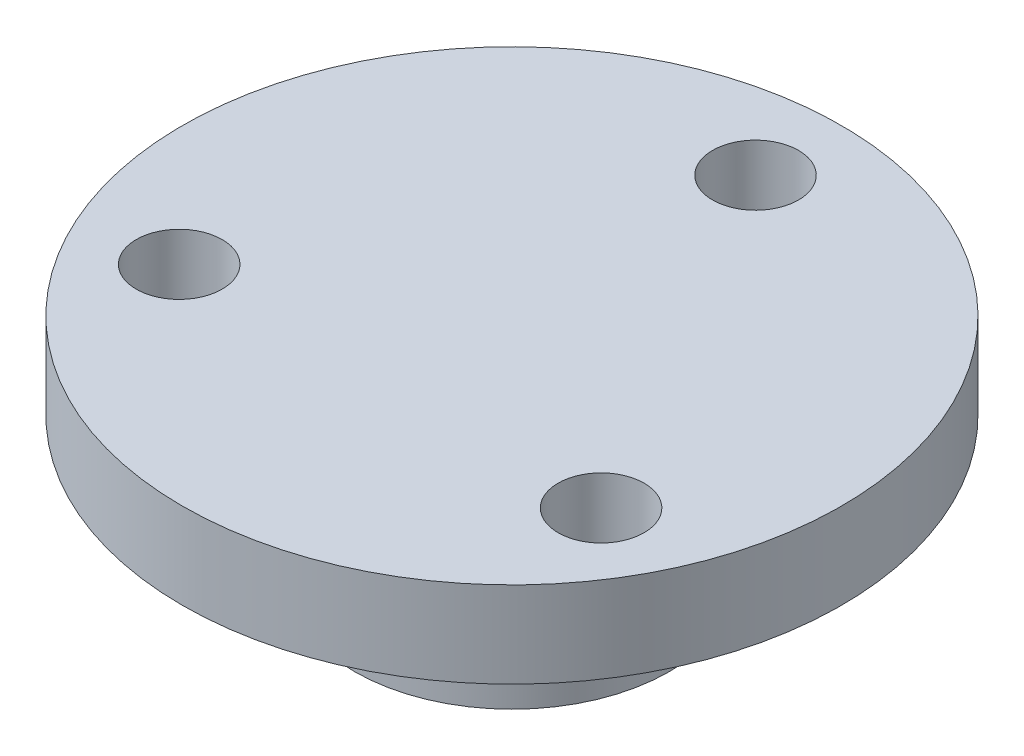
ISO-10303-21;
HEADER;
FILE_DESCRIPTION(('STEP AP214'),'2;1');
FILE_NAME('part.step','',(''),(''),'','','');
FILE_SCHEMA(('AUTOMOTIVE_DESIGN { 1 0 10303 214 1 1 1 1 }'));
ENDSEC;
DATA;
#1=APPLICATION_CONTEXT('core data for automotive mechanical design processes');
#2=APPLICATION_PROTOCOL_DEFINITION('international standard','automotive_design',2000,#1);
#3=PRODUCT_CONTEXT('',#1,'mechanical');
#4=PRODUCT('Part','Part','',(#3));
#5=PRODUCT_RELATED_PRODUCT_CATEGORY('part','',(#4));
#6=PRODUCT_DEFINITION_FORMATION('','',#4);
#7=PRODUCT_DEFINITION_CONTEXT('part definition',#1,'design');
#8=PRODUCT_DEFINITION('design','',#6,#7);
#9=PRODUCT_DEFINITION_SHAPE('','',#8);
#10=(LENGTH_UNIT() NAMED_UNIT(*) SI_UNIT(.MILLI.,.METRE.));
#11=(NAMED_UNIT(*) PLANE_ANGLE_UNIT() SI_UNIT($,.RADIAN.));
#12=(NAMED_UNIT(*) SI_UNIT($,.STERADIAN.) SOLID_ANGLE_UNIT());
#13=UNCERTAINTY_MEASURE_WITH_UNIT(LENGTH_MEASURE(1.E-05),#10,'distance_accuracy_value','');
#14=(GEOMETRIC_REPRESENTATION_CONTEXT(3) GLOBAL_UNCERTAINTY_ASSIGNED_CONTEXT((#13)) GLOBAL_UNIT_ASSIGNED_CONTEXT((#10,
#11,#12)) REPRESENTATION_CONTEXT('',''));
#15=CARTESIAN_POINT('',(0.,0.,0.));
#16=DIRECTION('',(0.,0.,1.));
#17=DIRECTION('',(1.,0.,0.));
#18=AXIS2_PLACEMENT_3D('',#15,#16,#17);
#19=CARTESIAN_POINT('',(0.,0.,0.));
#20=DIRECTION('',(0.,1.,0.));
#21=DIRECTION('',(0.,0.,1.));
#22=AXIS2_PLACEMENT_3D('',#19,#20,#21);
#23=PLANE('',#22);
#24=CARTESIAN_POINT('',(0.,0.,0.));
#25=DIRECTION('',(0.,1.,0.));
#26=DIRECTION('',(0.,0.,1.));
#27=AXIS2_PLACEMENT_3D('',#24,#25,#26);
#28=CIRCLE('',#27,1.5);
#29=CARTESIAN_POINT('',(1.095,0.,1.02517071749051));
#30=VERTEX_POINT('',#29);
#31=CARTESIAN_POINT('',(-1.095,0.,1.02517071749051));
#32=VERTEX_POINT('',#31);
#33=EDGE_CURVE('E111',#30,#32,#28,.T.);
#34=ORIENTED_EDGE('',*,*,#33,.T.);
#35=DIRECTION('',(1.,0.,0.));
#36=VECTOR('',#35,1.);
#37=CARTESIAN_POINT('',(-1.095,0.,1.02517071749051));
#38=LINE('',#37,#36);
#39=EDGE_CURVE('E121',#32,#30,#38,.T.);
#40=ORIENTED_EDGE('',*,*,#39,.T.);
#41=EDGE_LOOP('',(#34,#40));
#42=FACE_BOUND('',#41,.T.);
#43=CARTESIAN_POINT('',(0.,0.,0.));
#44=DIRECTION('',(0.,1.,0.));
#45=DIRECTION('',(0.,0.,1.));
#46=AXIS2_PLACEMENT_3D('',#43,#44,#45);
#47=CIRCLE('',#46,5.5);
#48=CARTESIAN_POINT('',(0.,0.,5.5));
#49=VERTEX_POINT('',#48);
#50=EDGE_CURVE('E43',#49,#49,#47,.T.);
#51=ORIENTED_EDGE('',*,*,#50,.F.);
#52=EDGE_LOOP('',(#51));
#53=FACE_BOUND('',#52,.T.);
#54=DIRECTION('',(0.,0.,-1.));
#55=VECTOR('',#54,1.);
#56=CARTESIAN_POINT('',(2.,0.,2.02517071749051));
#57=LINE('',#56,#55);
#58=CARTESIAN_POINT('',(2.,0.,4.02517071749051));
#59=VERTEX_POINT('',#58);
#60=CARTESIAN_POINT('',(2.,0.,2.02517071749051));
#61=VERTEX_POINT('',#60);
#62=EDGE_CURVE('E59',#59,#61,#57,.T.);
#63=ORIENTED_EDGE('',*,*,#62,.T.);
#64=DIRECTION('',(-1.,0.,0.));
#65=VECTOR('',#64,1.);
#66=CARTESIAN_POINT('',(-2.,0.,2.02517071749051));
#67=LINE('',#66,#65);
#68=CARTESIAN_POINT('',(-2.,0.,2.02517071749051));
#69=VERTEX_POINT('',#68);
#70=EDGE_CURVE('E141',#61,#69,#67,.T.);
#71=ORIENTED_EDGE('',*,*,#70,.T.);
#72=DIRECTION('',(0.,0.,1.));
#73=VECTOR('',#72,1.);
#74=CARTESIAN_POINT('',(-2.,0.,2.02517071749051));
#75=LINE('',#74,#73);
#76=CARTESIAN_POINT('',(-2.,0.,4.02517071749051));
#77=VERTEX_POINT('',#76);
#78=EDGE_CURVE('E107',#69,#77,#75,.T.);
#79=ORIENTED_EDGE('',*,*,#78,.T.);
#80=DIRECTION('',(1.,0.,0.));
#81=VECTOR('',#80,1.);
#82=CARTESIAN_POINT('',(-2.,0.,4.02517071749051));
#83=LINE('',#82,#81);
#84=EDGE_CURVE('E143',#77,#59,#83,.T.);
#85=ORIENTED_EDGE('',*,*,#84,.T.);
#86=EDGE_LOOP('',(#63,#71,#79,#85));
#87=FACE_BOUND('',#86,.T.);
#88=ADVANCED_FACE('F33',(#42,#53,#87),#23,.F.);
#89=CARTESIAN_POINT('',(0.,5.,0.));
#90=DIRECTION('',(0.,-1.,0.));
#91=DIRECTION('',(0.,0.,-1.));
#92=AXIS2_PLACEMENT_3D('',#89,#90,#91);
#93=CYLINDRICAL_SURFACE('',#92,5.5);
#94=CARTESIAN_POINT('',(-0.95,2.5,5.41733329231274));
#95=CARTESIAN_POINT('',(-0.949997897887409,2.55293310324879,5.41733427051681));
#96=CARTESIAN_POINT('',(-0.945560935739189,2.60589439949198,5.41811752465385));
#97=CARTESIAN_POINT('',(-0.927939213686378,2.71032893479592,5.42116276570064));
#98=CARTESIAN_POINT('',(-0.914746567241776,2.76180078860546,5.42342608572864));
#99=CARTESIAN_POINT('',(-0.880026213397319,2.86173001988339,5.42916764431532));
#100=CARTESIAN_POINT('',(-0.858505694224756,2.91018995534482,5.4326448348655));
#101=CARTESIAN_POINT('',(-0.807758721408843,3.0028067024101,5.44042110341476));
#102=CARTESIAN_POINT('',(-0.778533060237859,3.04696395590465,5.44472009687907));
#103=CARTESIAN_POINT('',(-0.712875706764201,3.13019369523096,5.45370639179531));
#104=CARTESIAN_POINT('',(-0.676378384269887,3.1692140592962,5.45839698545037));
#105=CARTESIAN_POINT('',(-0.597355576031603,3.24060926240055,5.46760877144032));
#106=CARTESIAN_POINT('',(-0.554829722826958,3.27298369605155,5.47212995342771));
#107=CARTESIAN_POINT('',(-0.464617949909265,3.3303648482919,5.48052846750585));
#108=CARTESIAN_POINT('',(-0.416900622171812,3.35532287585005,5.48440147468845));
#109=CARTESIAN_POINT('',(-0.31787260081571,3.39684957880574,5.4910305583491));
#110=CARTESIAN_POINT('',(-0.266562158283063,3.41341883974367,5.4937867127814));
#111=CARTESIAN_POINT('',(-0.162343417126022,3.43753774828653,5.49784830209401));
#112=CARTESIAN_POINT('',(-0.109455964421925,3.44517506015298,5.49916782801026));
#113=CARTESIAN_POINT('',(-0.00313496665170346,3.45148602773252,5.50025594246084));
#114=CARTESIAN_POINT('',(0.0502985383900843,3.45016033577347,5.50002464386426));
#115=CARTESIAN_POINT('',(0.155594972086536,3.43865097671179,5.49804828493476));
#116=CARTESIAN_POINT('',(0.207468560439996,3.42856166658522,5.49631935004073));
#117=CARTESIAN_POINT('',(0.308775248672862,3.39996023089703,5.49155998721047));
#118=CARTESIAN_POINT('',(0.358208269923096,3.38144783415995,5.48852951737241));
#119=CARTESIAN_POINT('',(0.453509279226373,3.33643303720004,5.48148026833757));
#120=CARTESIAN_POINT('',(0.499358690415946,3.30989208221559,5.477456737819));
#121=CARTESIAN_POINT('',(0.585988557192125,3.24960185884309,5.46886782129479));
#122=CARTESIAN_POINT('',(0.626768572471971,3.21585196500748,5.46430238828897));
#123=CARTESIAN_POINT('',(0.702659996311622,3.14157948656176,5.45506664115899));
#124=CARTESIAN_POINT('',(0.737690645740425,3.10097440706403,5.45039573550182));
#125=CARTESIAN_POINT('',(0.800455158450994,3.0144212559401,5.44153281214407));
#126=CARTESIAN_POINT('',(0.82818894439409,2.96847312769094,5.43734079951951));
#127=CARTESIAN_POINT('',(0.875590322642799,2.87244078759157,5.42990982874443));
#128=CARTESIAN_POINT('',(0.895247631836272,2.82235139983357,5.426672087061));
#129=CARTESIAN_POINT('',(0.925846273168258,2.71951296444491,5.42153592139918));
#130=CARTESIAN_POINT('',(0.93678843341955,2.66676417001746,5.41963737017299));
#131=CARTESIAN_POINT('',(0.949531284924423,2.56082842548827,5.41741932952435));
#132=CARTESIAN_POINT('',(0.951447350701009,2.50765575774249,5.41707991214293));
#133=CARTESIAN_POINT('',(0.946391587029211,2.40174972558032,5.41796542113022));
#134=CARTESIAN_POINT('',(0.939420127480131,2.34901634297278,5.41919028239355));
#135=CARTESIAN_POINT('',(0.916885768805899,2.24585584348907,5.42304788377649));
#136=CARTESIAN_POINT('',(0.901382085475307,2.19541539627242,5.42567091633269));
#137=CARTESIAN_POINT('',(0.862285677945974,2.09784842924185,5.43202110469483));
#138=CARTESIAN_POINT('',(0.838692437878383,2.05072212100069,5.43574833091285));
#139=CARTESIAN_POINT('',(0.783816236336582,1.96060914196181,5.44393298885601));
#140=CARTESIAN_POINT('',(0.752459632972949,1.91766795026791,5.44839726849764));
#141=CARTESIAN_POINT('',(0.683047381400346,1.83761537042492,5.45753321049322));
#142=CARTESIAN_POINT('',(0.644991225665738,1.80050442435036,5.46220488853861));
#143=CARTESIAN_POINT('',(0.562747817658517,1.73274176266326,5.47129256386093));
#144=CARTESIAN_POINT('',(0.518496578243463,1.70216717358482,5.47570510517299));
#145=CARTESIAN_POINT('',(0.425418667474379,1.64888649347271,5.48372115763741));
#146=CARTESIAN_POINT('',(0.376592152490883,1.62618013364877,5.487324696425));
#147=CARTESIAN_POINT('',(0.27597432382542,1.58939921571987,5.4933017460719));
#148=CARTESIAN_POINT('',(0.224197858577843,1.57528499501867,5.4956809008725));
#149=CARTESIAN_POINT('',(0.118964866877249,1.55596158519642,5.49896503905717));
#150=CARTESIAN_POINT('',(0.065508489786369,1.55075160666137,5.49987015312337));
#151=CARTESIAN_POINT('',(-0.0408238389862251,1.5494086255008,5.50010217110637));
#152=CARTESIAN_POINT('',(-0.0936983035375368,1.55315851888213,5.49944943597284));
#153=CARTESIAN_POINT('',(-0.198052136317613,1.56937465561988,5.49668086886392));
#154=CARTESIAN_POINT('',(-0.249531513806804,1.58184084110383,5.4945650466028));
#155=CARTESIAN_POINT('',(-0.349584316742787,1.61508949156701,5.48910739115124));
#156=CARTESIAN_POINT('',(-0.398161377006128,1.63586129266289,5.48576713051793));
#157=CARTESIAN_POINT('',(-0.491158742756859,1.68511824151996,5.47822437466985));
#158=CARTESIAN_POINT('',(-0.535578827688737,1.71360379823594,5.47402183374303));
#159=CARTESIAN_POINT('',(-0.619589509337232,1.77789146890475,5.46515484663865));
#160=CARTESIAN_POINT('',(-0.659114196470528,1.8137790283969,5.46048536775899));
#161=CARTESIAN_POINT('',(-0.731621546802366,1.89167313840343,5.45124474685305));
#162=CARTESIAN_POINT('',(-0.764602674975876,1.93368112068223,5.44667362812433));
#163=CARTESIAN_POINT('',(-0.82332058718602,2.02300689833993,5.43810931901881));
#164=CARTESIAN_POINT('',(-0.84899991188984,2.07036292159311,5.43412082650114));
#165=CARTESIAN_POINT('',(-0.89199900487164,2.16876732578594,5.42722912577918));
#166=CARTESIAN_POINT('',(-0.909326996809598,2.21981201724101,5.42432485057082));
#167=CARTESIAN_POINT('',(-0.931435186358782,2.30920222906213,5.42056386016213));
#168=CARTESIAN_POINT('',(-0.938385613318888,2.34701118954113,5.41935925913401));
#169=CARTESIAN_POINT('',(-0.947668735450655,2.42320849474321,5.41774362848123));
#170=CARTESIAN_POINT('',(-0.950001525090866,2.46159682759718,5.41733258262188));
#171=CARTESIAN_POINT('',(-0.95,2.5,5.41733329231274));
#172=B_SPLINE_CURVE_WITH_KNOTS('',3,(#94,#95,#96,#97,#98,#99,#100,#101,#102,#103,#104,#105,#106,
#107,#108,#109,#110,#111,#112,#113,#114,#115,#116,#117,#118,#119,#120,#121,#122,#123,#124,#125,
#126,#127,#128,#129,#130,#131,#132,#133,#134,#135,#136,#137,#138,#139,#140,#141,#142,#143,#144,
#145,#146,#147,#148,#149,#150,#151,#152,#153,#154,#155,#156,#157,#158,#159,#160,#161,#162,#163,
#164,#165,#166,#167,#168,#169,#170,#171),.UNSPECIFIED.,.T.,.F.,(4,2,2,2,2,2,2,2,2,2,2,2,2,2,2,2,
2,2,2,2,2,2,2,2,2,2,2,2,2,2,2,2,2,2,2,2,2,2,4),(0.,0.158658848399674,0.317460800479306,
0.476125986840608,0.634774860879918,0.794926379679062,0.955087664491147,1.11627833587002,
1.27745775450206,1.43704160736248,1.59661384582741,1.754488989175,1.91236921556347,
2.07101998653704,2.22968452764667,2.39041584349775,2.55114886285413,2.71208590083009,
2.87300764475615,3.03186674856646,3.19071924086779,3.34848291124166,3.50625664403391,
3.66558853659005,3.82493250455675,3.98606392136082,4.14718983313648,4.3075662092651,
4.46792836633719,4.62620610603794,4.78448279485191,4.94255691564921,5.10063941859292,
5.2606606375023,5.42071935082377,5.58200478448936,5.74313107225723,5.85824103917919,
5.97334865113401),.UNSPECIFIED.);
#173=CARTESIAN_POINT('',(-0.95,2.5,5.41733329231274));
#174=VERTEX_POINT('',#173);
#175=EDGE_CURVE('E171',#174,#174,#172,.T.);
#176=ORIENTED_EDGE('',*,*,#175,.T.);
#177=EDGE_LOOP('',(#176));
#178=FACE_BOUND('',#177,.T.);
#179=CARTESIAN_POINT('',(0.,5.,0.));
#180=DIRECTION('',(0.,1.,0.));
#181=DIRECTION('',(0.,0.,1.));
#182=AXIS2_PLACEMENT_3D('',#179,#180,#181);
#183=CIRCLE('',#182,5.5);
#184=CARTESIAN_POINT('',(0.,5.,5.5));
#185=VERTEX_POINT('',#184);
#186=EDGE_CURVE('E11',#185,#185,#183,.T.);
#187=ORIENTED_EDGE('',*,*,#186,.F.);
#188=EDGE_LOOP('',(#187));
#189=FACE_BOUND('',#188,.T.);
#190=ORIENTED_EDGE('',*,*,#50,.T.);
#191=EDGE_LOOP('',(#190));
#192=FACE_BOUND('',#191,.T.);
#193=ADVANCED_FACE('F35',(#178,#189,#192),#93,.T.);
#194=CARTESIAN_POINT('',(0.,5.,0.));
#195=DIRECTION('',(0.,-1.,0.));
#196=DIRECTION('',(0.,0.,-1.));
#197=AXIS2_PLACEMENT_3D('',#194,#195,#196);
#198=CYLINDRICAL_SURFACE('',#197,1.5);
#199=ORIENTED_EDGE('',*,*,#33,.F.);
#200=DIRECTION('',(0.,-1.,0.));
#201=VECTOR('',#200,1.);
#202=CARTESIAN_POINT('',(1.095,5.,1.02517071749051));
#203=LINE('',#202,#201);
#204=CARTESIAN_POINT('',(1.095,5.,1.02517071749051));
#205=VERTEX_POINT('',#204);
#206=EDGE_CURVE('E124',#205,#30,#203,.T.);
#207=ORIENTED_EDGE('',*,*,#206,.F.);
#208=CARTESIAN_POINT('',(0.,5.,0.));
#209=DIRECTION('',(0.,1.,0.));
#210=DIRECTION('',(0.,0.,1.));
#211=AXIS2_PLACEMENT_3D('',#208,#209,#210);
#212=CIRCLE('',#211,1.5);
#213=CARTESIAN_POINT('',(-1.095,5.,1.02517071749051));
#214=VERTEX_POINT('',#213);
#215=EDGE_CURVE('E117',#205,#214,#212,.T.);
#216=ORIENTED_EDGE('',*,*,#215,.T.);
#217=DIRECTION('',(0.,-1.,0.));
#218=VECTOR('',#217,1.);
#219=CARTESIAN_POINT('',(-1.095,5.,1.02517071749051));
#220=LINE('',#219,#218);
#221=EDGE_CURVE('E131',#214,#32,#220,.T.);
#222=ORIENTED_EDGE('',*,*,#221,.T.);
#223=EDGE_LOOP('',(#199,#207,#216,#222));
#224=FACE_BOUND('',#223,.T.);
#225=ADVANCED_FACE('F229',(#224),#198,.F.);
#226=CARTESIAN_POINT('',(-1.095,5.,1.02517071749051));
#227=DIRECTION('',(0.,0.,-1.));
#228=DIRECTION('',(-1.,0.,0.));
#229=AXIS2_PLACEMENT_3D('',#226,#227,#228);
#230=PLANE('',#229);
#231=CARTESIAN_POINT('',(0.,2.5,1.02517071749051));
#232=DIRECTION('',(0.,0.,-1.));
#233=DIRECTION('',(-1.,0.,0.));
#234=AXIS2_PLACEMENT_3D('',#231,#232,#233);
#235=CIRCLE('',#234,0.95);
#236=CARTESIAN_POINT('',(-0.95,2.5,1.02517071749051));
#237=VERTEX_POINT('',#236);
#238=EDGE_CURVE('E371',#237,#237,#235,.T.);
#239=ORIENTED_EDGE('',*,*,#238,.F.);
#240=EDGE_LOOP('',(#239));
#241=FACE_BOUND('',#240,.T.);
#242=ORIENTED_EDGE('',*,*,#39,.F.);
#243=ORIENTED_EDGE('',*,*,#221,.F.);
#244=DIRECTION('',(1.,0.,0.));
#245=VECTOR('',#244,1.);
#246=CARTESIAN_POINT('',(-1.095,5.,1.02517071749051));
#247=LINE('',#246,#245);
#248=EDGE_CURVE('E120',#214,#205,#247,.T.);
#249=ORIENTED_EDGE('',*,*,#248,.T.);
#250=ORIENTED_EDGE('',*,*,#206,.T.);
#251=EDGE_LOOP('',(#242,#243,#249,#250));
#252=FACE_BOUND('',#251,.T.);
#253=ADVANCED_FACE('F226',(#241,#252),#230,.T.);
#254=CARTESIAN_POINT('',(2.,5.,2.02517071749051));
#255=DIRECTION('',(-1.,0.,0.));
#256=DIRECTION('',(0.,0.,1.));
#257=AXIS2_PLACEMENT_3D('',#254,#255,#256);
#258=PLANE('',#257);
#259=ORIENTED_EDGE('',*,*,#62,.F.);
#260=DIRECTION('',(0.,-1.,0.));
#261=VECTOR('',#260,1.);
#262=CARTESIAN_POINT('',(2.,5.,4.02517071749051));
#263=LINE('',#262,#261);
#264=CARTESIAN_POINT('',(2.,5.,4.02517071749051));
#265=VERTEX_POINT('',#264);
#266=EDGE_CURVE('E113',#265,#59,#263,.T.);
#267=ORIENTED_EDGE('',*,*,#266,.F.);
#268=DIRECTION('',(0.,0.,-1.));
#269=VECTOR('',#268,1.);
#270=CARTESIAN_POINT('',(2.,5.,2.02517071749051));
#271=LINE('',#270,#269);
#272=CARTESIAN_POINT('',(2.,5.,2.02517071749051));
#273=VERTEX_POINT('',#272);
#274=EDGE_CURVE('E103',#265,#273,#271,.T.);
#275=ORIENTED_EDGE('',*,*,#274,.T.);
#276=DIRECTION('',(0.,-1.,0.));
#277=VECTOR('',#276,1.);
#278=CARTESIAN_POINT('',(2.,5.,2.02517071749051));
#279=LINE('',#278,#277);
#280=EDGE_CURVE('E102',#273,#61,#279,.T.);
#281=ORIENTED_EDGE('',*,*,#280,.T.);
#282=EDGE_LOOP('',(#259,#267,#275,#281));
#283=FACE_BOUND('',#282,.T.);
#284=ADVANCED_FACE('F155',(#283),#258,.T.);
#285=CARTESIAN_POINT('',(-2.,5.,2.02517071749051));
#286=DIRECTION('',(0.,0.,1.));
#287=DIRECTION('',(1.,0.,0.));
#288=AXIS2_PLACEMENT_3D('',#285,#286,#287);
#289=PLANE('',#288);
#290=CARTESIAN_POINT('',(0.,2.5,2.02517071749051));
#291=DIRECTION('',(0.,0.,1.));
#292=DIRECTION('',(1.,0.,0.));
#293=AXIS2_PLACEMENT_3D('',#290,#291,#292);
#294=CIRCLE('',#293,0.95);
#295=CARTESIAN_POINT('',(0.95,2.5,2.02517071749051));
#296=VERTEX_POINT('',#295);
#297=EDGE_CURVE('E184',#296,#296,#294,.T.);
#298=ORIENTED_EDGE('',*,*,#297,.F.);
#299=EDGE_LOOP('',(#298));
#300=FACE_BOUND('',#299,.T.);
#301=ORIENTED_EDGE('',*,*,#70,.F.);
#302=ORIENTED_EDGE('',*,*,#280,.F.);
#303=DIRECTION('',(-1.,0.,0.));
#304=VECTOR('',#303,1.);
#305=CARTESIAN_POINT('',(-2.,5.,2.02517071749051));
#306=LINE('',#305,#304);
#307=CARTESIAN_POINT('',(-2.,5.,2.02517071749051));
#308=VERTEX_POINT('',#307);
#309=EDGE_CURVE('E92',#273,#308,#306,.T.);
#310=ORIENTED_EDGE('',*,*,#309,.T.);
#311=DIRECTION('',(0.,-1.,0.));
#312=VECTOR('',#311,1.);
#313=CARTESIAN_POINT('',(-2.,5.,2.02517071749051));
#314=LINE('',#313,#312);
#315=EDGE_CURVE('E100',#308,#69,#314,.T.);
#316=ORIENTED_EDGE('',*,*,#315,.T.);
#317=EDGE_LOOP('',(#301,#302,#310,#316));
#318=FACE_BOUND('',#317,.T.);
#319=ADVANCED_FACE('F99',(#300,#318),#289,.T.);
#320=CARTESIAN_POINT('',(-2.,5.,2.02517071749051));
#321=DIRECTION('',(1.,0.,0.));
#322=DIRECTION('',(0.,0.,-1.));
#323=AXIS2_PLACEMENT_3D('',#320,#321,#322);
#324=PLANE('',#323);
#325=ORIENTED_EDGE('',*,*,#78,.F.);
#326=ORIENTED_EDGE('',*,*,#315,.F.);
#327=DIRECTION('',(0.,0.,1.));
#328=VECTOR('',#327,1.);
#329=CARTESIAN_POINT('',(-2.,5.,2.02517071749051));
#330=LINE('',#329,#328);
#331=CARTESIAN_POINT('',(-2.,5.,4.02517071749051));
#332=VERTEX_POINT('',#331);
#333=EDGE_CURVE('E89',#308,#332,#330,.T.);
#334=ORIENTED_EDGE('',*,*,#333,.T.);
#335=DIRECTION('',(0.,-1.,0.));
#336=VECTOR('',#335,1.);
#337=CARTESIAN_POINT('',(-2.,5.,4.02517071749051));
#338=LINE('',#337,#336);
#339=EDGE_CURVE('E109',#332,#77,#338,.T.);
#340=ORIENTED_EDGE('',*,*,#339,.T.);
#341=EDGE_LOOP('',(#325,#326,#334,#340));
#342=FACE_BOUND('',#341,.T.);
#343=ADVANCED_FACE('F105',(#342),#324,.T.);
#344=CARTESIAN_POINT('',(-2.,5.,4.02517071749051));
#345=DIRECTION('',(0.,0.,-1.));
#346=DIRECTION('',(-1.,0.,0.));
#347=AXIS2_PLACEMENT_3D('',#344,#345,#346);
#348=PLANE('',#347);
#349=CARTESIAN_POINT('',(0.,2.5,4.02517071749051));
#350=DIRECTION('',(0.,0.,-1.));
#351=DIRECTION('',(-1.,0.,0.));
#352=AXIS2_PLACEMENT_3D('',#349,#350,#351);
#353=CIRCLE('',#352,0.95);
#354=CARTESIAN_POINT('',(-0.95,2.5,4.02517071749051));
#355=VERTEX_POINT('',#354);
#356=EDGE_CURVE('E38',#355,#355,#353,.T.);
#357=ORIENTED_EDGE('',*,*,#356,.F.);
#358=EDGE_LOOP('',(#357));
#359=FACE_BOUND('',#358,.T.);
#360=ORIENTED_EDGE('',*,*,#84,.F.);
#361=ORIENTED_EDGE('',*,*,#339,.F.);
#362=DIRECTION('',(1.,0.,0.));
#363=VECTOR('',#362,1.);
#364=CARTESIAN_POINT('',(-2.,5.,4.02517071749051));
#365=LINE('',#364,#363);
#366=EDGE_CURVE('E51',#332,#265,#365,.T.);
#367=ORIENTED_EDGE('',*,*,#366,.T.);
#368=ORIENTED_EDGE('',*,*,#266,.T.);
#369=EDGE_LOOP('',(#360,#361,#367,#368));
#370=FACE_BOUND('',#369,.T.);
#371=ADVANCED_FACE('F154',(#359,#370),#348,.T.);
#372=CARTESIAN_POINT('',(0.,5.,0.));
#373=DIRECTION('',(0.,1.,0.));
#374=DIRECTION('',(0.,0.,1.));
#375=AXIS2_PLACEMENT_3D('',#372,#373,#374);
#376=PLANE('',#375);
#377=ORIENTED_EDGE('',*,*,#309,.F.);
#378=ORIENTED_EDGE('',*,*,#274,.F.);
#379=ORIENTED_EDGE('',*,*,#366,.F.);
#380=ORIENTED_EDGE('',*,*,#333,.F.);
#381=EDGE_LOOP('',(#377,#378,#379,#380));
#382=FACE_BOUND('',#381,.T.);
#383=ADVANCED_FACE('F91',(#382),#376,.F.);
#384=ORIENTED_EDGE('',*,*,#248,.F.);
#385=ORIENTED_EDGE('',*,*,#215,.F.);
#386=EDGE_LOOP('',(#384,#385));
#387=FACE_BOUND('',#386,.T.);
#388=ADVANCED_FACE('F211',(#387),#376,.F.);
#389=CARTESIAN_POINT('',(-7.36121593216771,5.,4.25000000000003));
#390=DIRECTION('',(0.,-1.,0.));
#391=DIRECTION('',(-0.866025403784436,0.,0.500000000000004));
#392=AXIS2_PLACEMENT_3D('',#389,#390,#391);
#393=CIRCLE('',#392,1.5);
#394=CARTESIAN_POINT('',(-8.66025403784437,5.,5.00000000000004));
#395=VERTEX_POINT('',#394);
#396=EDGE_CURVE('E174',#395,#395,#393,.T.);
#397=ORIENTED_EDGE('',*,*,#396,.F.);
#398=EDGE_LOOP('',(#397));
#399=FACE_BOUND('',#398,.T.);
#400=CARTESIAN_POINT('',(7.36121593216777,5.,4.24999999999993));
#401=DIRECTION('',(0.,-1.,0.));
#402=DIRECTION('',(0.866025403784443,0.,0.499999999999992));
#403=AXIS2_PLACEMENT_3D('',#400,#401,#402);
#404=CIRCLE('',#403,1.5);
#405=CARTESIAN_POINT('',(8.66025403784443,5.,4.99999999999992));
#406=VERTEX_POINT('',#405);
#407=EDGE_CURVE('E167',#406,#406,#404,.T.);
#408=ORIENTED_EDGE('',*,*,#407,.F.);
#409=EDGE_LOOP('',(#408));
#410=FACE_BOUND('',#409,.T.);
#411=CARTESIAN_POINT('',(0.,5.,-8.5));
#412=DIRECTION('',(0.,-1.,0.));
#413=DIRECTION('',(0.,0.,-1.));
#414=AXIS2_PLACEMENT_3D('',#411,#412,#413);
#415=CIRCLE('',#414,1.5);
#416=CARTESIAN_POINT('',(0.,5.,-10.));
#417=VERTEX_POINT('',#416);
#418=EDGE_CURVE('E161',#417,#417,#415,.T.);
#419=ORIENTED_EDGE('',*,*,#418,.F.);
#420=EDGE_LOOP('',(#419));
#421=FACE_BOUND('',#420,.T.);
#422=CARTESIAN_POINT('',(0.,5.,0.));
#423=DIRECTION('',(0.,1.,0.));
#424=DIRECTION('',(0.,0.,1.));
#425=AXIS2_PLACEMENT_3D('',#422,#423,#424);
#426=CIRCLE('',#425,11.5);
#427=CARTESIAN_POINT('',(0.,5.,11.5));
#428=VERTEX_POINT('',#427);
#429=EDGE_CURVE('E148',#428,#428,#426,.T.);
#430=ORIENTED_EDGE('',*,*,#429,.F.);
#431=EDGE_LOOP('',(#430));
#432=FACE_BOUND('',#431,.T.);
#433=ORIENTED_EDGE('',*,*,#186,.T.);
#434=EDGE_LOOP('',(#433));
#435=FACE_BOUND('',#434,.T.);
#436=ADVANCED_FACE('F212',(#399,#410,#421,#432,#435),#376,.F.);
#437=CARTESIAN_POINT('',(0.,8.,0.));
#438=DIRECTION('',(0.,-1.,0.));
#439=DIRECTION('',(0.,0.,-1.));
#440=AXIS2_PLACEMENT_3D('',#437,#438,#439);
#441=CYLINDRICAL_SURFACE('',#440,11.5);
#442=CARTESIAN_POINT('',(0.,8.,0.));
#443=DIRECTION('',(0.,1.,0.));
#444=DIRECTION('',(0.,0.,1.));
#445=AXIS2_PLACEMENT_3D('',#442,#443,#444);
#446=CIRCLE('',#445,11.5);
#447=CARTESIAN_POINT('',(0.,8.,11.5));
#448=VERTEX_POINT('',#447);
#449=EDGE_CURVE('E144',#448,#448,#446,.T.);
#450=ORIENTED_EDGE('',*,*,#449,.F.);
#451=EDGE_LOOP('',(#450));
#452=FACE_BOUND('',#451,.T.);
#453=ORIENTED_EDGE('',*,*,#429,.T.);
#454=EDGE_LOOP('',(#453));
#455=FACE_BOUND('',#454,.T.);
#456=ADVANCED_FACE('F207',(#452,#455),#441,.T.);
#457=CARTESIAN_POINT('',(0.,8.,0.));
#458=DIRECTION('',(0.,1.,0.));
#459=DIRECTION('',(0.,0.,1.));
#460=AXIS2_PLACEMENT_3D('',#457,#458,#459);
#461=PLANE('',#460);
#462=CARTESIAN_POINT('',(-7.36121593216771,8.,4.25000000000003));
#463=DIRECTION('',(0.,-1.,0.));
#464=DIRECTION('',(-0.866025403784436,0.,0.500000000000004));
#465=AXIS2_PLACEMENT_3D('',#462,#463,#464);
#466=CIRCLE('',#465,1.5);
#467=CARTESIAN_POINT('',(-8.66025403784437,8.,5.00000000000004));
#468=VERTEX_POINT('',#467);
#469=EDGE_CURVE('E164',#468,#468,#466,.T.);
#470=ORIENTED_EDGE('',*,*,#469,.T.);
#471=EDGE_LOOP('',(#470));
#472=FACE_BOUND('',#471,.T.);
#473=CARTESIAN_POINT('',(7.36121593216777,8.,4.24999999999993));
#474=DIRECTION('',(0.,-1.,0.));
#475=DIRECTION('',(0.866025403784443,0.,0.499999999999992));
#476=AXIS2_PLACEMENT_3D('',#473,#474,#475);
#477=CIRCLE('',#476,1.5);
#478=CARTESIAN_POINT('',(8.66025403784443,8.,4.99999999999992));
#479=VERTEX_POINT('',#478);
#480=EDGE_CURVE('E170',#479,#479,#477,.T.);
#481=ORIENTED_EDGE('',*,*,#480,.T.);
#482=EDGE_LOOP('',(#481));
#483=FACE_BOUND('',#482,.T.);
#484=CARTESIAN_POINT('',(0.,8.,-8.5));
#485=DIRECTION('',(0.,-1.,0.));
#486=DIRECTION('',(0.,0.,-1.));
#487=AXIS2_PLACEMENT_3D('',#484,#485,#486);
#488=CIRCLE('',#487,1.5);
#489=CARTESIAN_POINT('',(0.,8.,-10.));
#490=VERTEX_POINT('',#489);
#491=EDGE_CURVE('E159',#490,#490,#488,.T.);
#492=ORIENTED_EDGE('',*,*,#491,.T.);
#493=EDGE_LOOP('',(#492));
#494=FACE_BOUND('',#493,.T.);
#495=ORIENTED_EDGE('',*,*,#449,.T.);
#496=EDGE_LOOP('',(#495));
#497=FACE_BOUND('',#496,.T.);
#498=ADVANCED_FACE('F203',(#472,#483,#494,#497),#461,.T.);
#499=CARTESIAN_POINT('',(0.,8.,-8.5));
#500=DIRECTION('',(0.,-1.,0.));
#501=DIRECTION('',(0.,0.,-1.));
#502=AXIS2_PLACEMENT_3D('',#499,#500,#501);
#503=CYLINDRICAL_SURFACE('',#502,1.5);
#504=ORIENTED_EDGE('',*,*,#491,.F.);
#505=EDGE_LOOP('',(#504));
#506=FACE_BOUND('',#505,.T.);
#507=ORIENTED_EDGE('',*,*,#418,.T.);
#508=EDGE_LOOP('',(#507));
#509=FACE_BOUND('',#508,.T.);
#510=ADVANCED_FACE('F199',(#506,#509),#503,.F.);
#511=CARTESIAN_POINT('',(7.36121593216777,8.,4.24999999999993));
#512=DIRECTION('',(0.,-1.,0.));
#513=DIRECTION('',(0.,0.,-1.));
#514=AXIS2_PLACEMENT_3D('',#511,#512,#513);
#515=CYLINDRICAL_SURFACE('',#514,1.5);
#516=ORIENTED_EDGE('',*,*,#480,.F.);
#517=EDGE_LOOP('',(#516));
#518=FACE_BOUND('',#517,.T.);
#519=ORIENTED_EDGE('',*,*,#407,.T.);
#520=EDGE_LOOP('',(#519));
#521=FACE_BOUND('',#520,.T.);
#522=ADVANCED_FACE('F195',(#518,#521),#515,.F.);
#523=CARTESIAN_POINT('',(-7.36121593216771,8.,4.25000000000003));
#524=DIRECTION('',(0.,-1.,0.));
#525=DIRECTION('',(0.,0.,-1.));
#526=AXIS2_PLACEMENT_3D('',#523,#524,#525);
#527=CYLINDRICAL_SURFACE('',#526,1.5);
#528=ORIENTED_EDGE('',*,*,#469,.F.);
#529=EDGE_LOOP('',(#528));
#530=FACE_BOUND('',#529,.T.);
#531=ORIENTED_EDGE('',*,*,#396,.T.);
#532=EDGE_LOOP('',(#531));
#533=FACE_BOUND('',#532,.T.);
#534=ADVANCED_FACE('F191',(#530,#533),#527,.F.);
#535=CARTESIAN_POINT('',(0.,2.5,11.5));
#536=DIRECTION('',(0.,0.,-1.));
#537=DIRECTION('',(-1.,0.,0.));
#538=AXIS2_PLACEMENT_3D('',#535,#536,#537);
#539=CYLINDRICAL_SURFACE('',#538,0.95);
#540=ORIENTED_EDGE('',*,*,#356,.T.);
#541=EDGE_LOOP('',(#540));
#542=FACE_BOUND('',#541,.T.);
#543=ORIENTED_EDGE('',*,*,#175,.F.);
#544=EDGE_LOOP('',(#543));
#545=FACE_BOUND('',#544,.T.);
#546=ADVANCED_FACE('F186',(#542,#545),#539,.F.);
#547=ORIENTED_EDGE('',*,*,#297,.T.);
#548=EDGE_LOOP('',(#547));
#549=FACE_BOUND('',#548,.T.);
#550=ORIENTED_EDGE('',*,*,#238,.T.);
#551=EDGE_LOOP('',(#550));
#552=FACE_BOUND('',#551,.T.);
#553=ADVANCED_FACE('F190',(#549,#552),#539,.F.);
#554=CLOSED_SHELL('',(#88,#193,#225,#253,#284,#319,#343,#371,#383,#388,#436,#456,#498,#510,#522,
#534,#546,#553));
#555=MANIFOLD_SOLID_BREP('B2',#554);
#556=ADVANCED_BREP_SHAPE_REPRESENTATION('',(#18,#555),#14);
#557=SHAPE_DEFINITION_REPRESENTATION(#9,#556);
ENDSEC;
END-ISO-10303-21;
